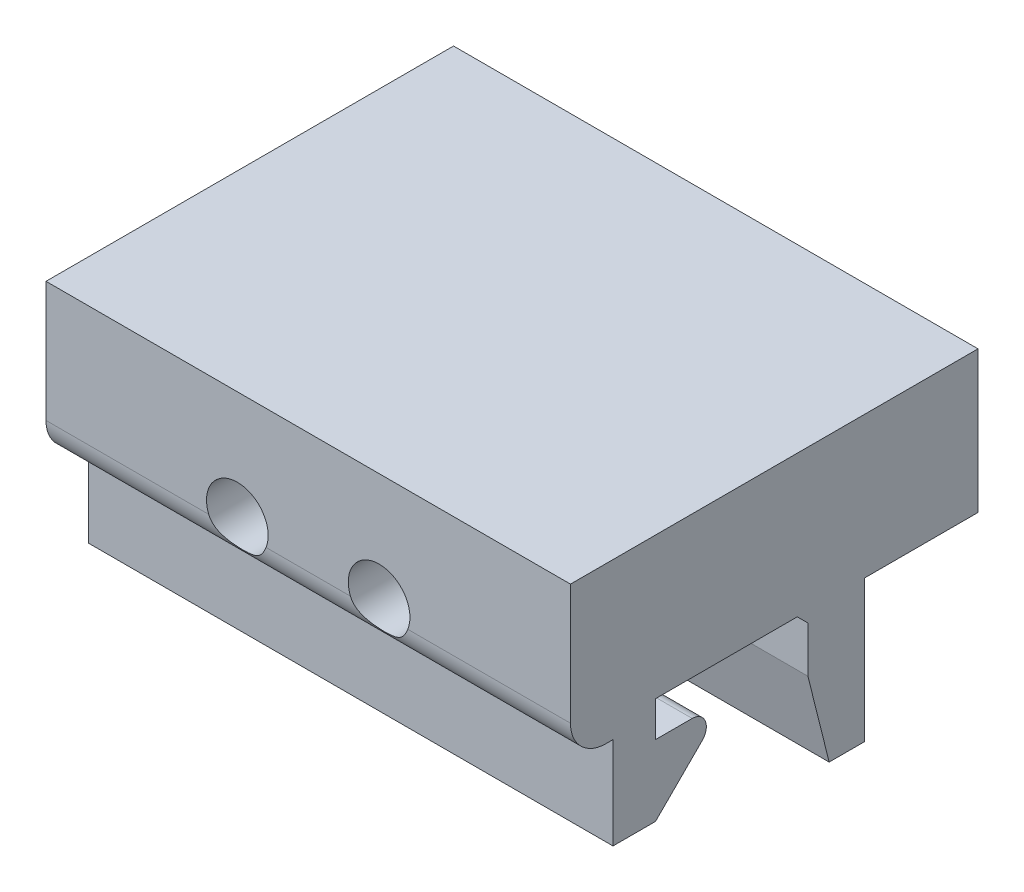
ISO-10303-21;
HEADER;
FILE_DESCRIPTION(('STEP AP214'),'2;1');
FILE_NAME('part.step','',(''),(''),'','','');
FILE_SCHEMA(('AUTOMOTIVE_DESIGN { 1 0 10303 214 1 1 1 1 }'));
ENDSEC;
DATA;
#1=APPLICATION_CONTEXT('core data for automotive mechanical design processes');
#2=APPLICATION_PROTOCOL_DEFINITION('international standard','automotive_design',2000,#1);
#3=PRODUCT_CONTEXT('',#1,'mechanical');
#4=PRODUCT('Part','Part','',(#3));
#5=PRODUCT_RELATED_PRODUCT_CATEGORY('part','',(#4));
#6=PRODUCT_DEFINITION_FORMATION('','',#4);
#7=PRODUCT_DEFINITION_CONTEXT('part definition',#1,'design');
#8=PRODUCT_DEFINITION('design','',#6,#7);
#9=PRODUCT_DEFINITION_SHAPE('','',#8);
#10=(LENGTH_UNIT() NAMED_UNIT(*) SI_UNIT(.MILLI.,.METRE.));
#11=(NAMED_UNIT(*) PLANE_ANGLE_UNIT() SI_UNIT($,.RADIAN.));
#12=(NAMED_UNIT(*) SI_UNIT($,.STERADIAN.) SOLID_ANGLE_UNIT());
#13=UNCERTAINTY_MEASURE_WITH_UNIT(LENGTH_MEASURE(1.E-05),#10,'distance_accuracy_value','');
#14=(GEOMETRIC_REPRESENTATION_CONTEXT(3) GLOBAL_UNCERTAINTY_ASSIGNED_CONTEXT((#13)) GLOBAL_UNIT_ASSIGNED_CONTEXT((#10,
#11,#12)) REPRESENTATION_CONTEXT('',''));
#15=CARTESIAN_POINT('',(0.,0.,0.));
#16=DIRECTION('',(0.,0.,1.));
#17=DIRECTION('',(1.,0.,0.));
#18=AXIS2_PLACEMENT_3D('',#15,#16,#17);
#19=CARTESIAN_POINT('',(37.,0.,3.));
#20=DIRECTION('',(0.,0.,-1.));
#21=DIRECTION('',(0.,1.,0.));
#22=AXIS2_PLACEMENT_3D('',#19,#20,#21);
#23=PLANE('',#22);
#24=DIRECTION('',(-1.,0.,0.));
#25=VECTOR('',#24,1.);
#26=CARTESIAN_POINT('',(37.,-8.5,3.));
#27=LINE('',#26,#25);
#28=CARTESIAN_POINT('',(11.4774706429819,-8.5,3.));
#29=VERTEX_POINT('',#28);
#30=CARTESIAN_POINT('',(0.,-8.5,3.));
#31=VERTEX_POINT('',#30);
#32=EDGE_CURVE('E191',#29,#31,#27,.T.);
#33=ORIENTED_EDGE('',*,*,#32,.F.);
#34=CARTESIAN_POINT('',(13.5,-7.7,3.));
#35=DIRECTION('',(0.,0.,-1.));
#36=DIRECTION('',(0.,1.,0.));
#37=AXIS2_PLACEMENT_3D('',#34,#35,#36);
#38=CIRCLE('',#37,2.175);
#39=CARTESIAN_POINT('',(15.5225293570181,-8.5,3.));
#40=VERTEX_POINT('',#39);
#41=EDGE_CURVE('E53',#29,#40,#38,.T.);
#42=ORIENTED_EDGE('',*,*,#41,.T.);
#43=CARTESIAN_POINT('',(21.4774706429819,-8.5,3.));
#44=VERTEX_POINT('',#43);
#45=EDGE_CURVE('E185',#44,#40,#27,.T.);
#46=ORIENTED_EDGE('',*,*,#45,.F.);
#47=CARTESIAN_POINT('',(23.5,-7.7,3.));
#48=DIRECTION('',(0.,0.,-1.));
#49=DIRECTION('',(0.,1.,0.));
#50=AXIS2_PLACEMENT_3D('',#47,#48,#49);
#51=CIRCLE('',#50,2.175);
#52=CARTESIAN_POINT('',(25.5225293570181,-8.5,3.));
#53=VERTEX_POINT('',#52);
#54=EDGE_CURVE('E60',#44,#53,#51,.T.);
#55=ORIENTED_EDGE('',*,*,#54,.T.);
#56=CARTESIAN_POINT('',(37.,-8.5,3.));
#57=VERTEX_POINT('',#56);
#58=EDGE_CURVE('E47',#57,#53,#27,.T.);
#59=ORIENTED_EDGE('',*,*,#58,.F.);
#60=DIRECTION('',(0.,-1.,0.));
#61=VECTOR('',#60,1.);
#62=CARTESIAN_POINT('',(37.,0.,3.));
#63=LINE('',#62,#61);
#64=CARTESIAN_POINT('',(37.,0.,3.));
#65=VERTEX_POINT('',#64);
#66=EDGE_CURVE('E315',#65,#57,#63,.T.);
#67=ORIENTED_EDGE('',*,*,#66,.F.);
#68=DIRECTION('',(-1.,0.,0.));
#69=VECTOR('',#68,1.);
#70=CARTESIAN_POINT('',(37.,0.,3.));
#71=LINE('',#70,#69);
#72=CARTESIAN_POINT('',(0.,0.,3.));
#73=VERTEX_POINT('',#72);
#74=EDGE_CURVE('E12',#65,#73,#71,.T.);
#75=ORIENTED_EDGE('',*,*,#74,.T.);
#76=DIRECTION('',(0.,-1.,0.));
#77=VECTOR('',#76,1.);
#78=CARTESIAN_POINT('',(0.,0.,3.));
#79=LINE('',#78,#77);
#80=EDGE_CURVE('E282',#73,#31,#79,.T.);
#81=ORIENTED_EDGE('',*,*,#80,.T.);
#82=EDGE_LOOP('',(#33,#42,#46,#55,#59,#67,#75,#81));
#83=FACE_BOUND('',#82,.T.);
#84=ADVANCED_FACE('F40',(#83),#23,.F.);
#85=CARTESIAN_POINT('',(37.,-8.5,0.5));
#86=DIRECTION('',(-1.,0.,0.));
#87=DIRECTION('',(0.,0.,1.));
#88=AXIS2_PLACEMENT_3D('',#85,#86,#87);
#89=CYLINDRICAL_SURFACE('',#88,2.5);
#90=ORIENTED_EDGE('',*,*,#45,.T.);
#91=CARTESIAN_POINT('',(15.5225293570181,-8.5,3.));
#92=CARTESIAN_POINT('',(15.5015826202919,-8.55298797162307,3.0000097026096));
#93=CARTESIAN_POINT('',(15.4785430854911,-8.6051186813735,2.99831591961302));
#94=CARTESIAN_POINT('',(15.4285642058998,-8.7072130496289,2.99191943818065));
#95=CARTESIAN_POINT('',(15.4016294264473,-8.75717915722952,2.98722024041105));
#96=CARTESIAN_POINT('',(15.3443056379318,-8.85426168741713,2.97525294985885));
#97=CARTESIAN_POINT('',(15.3139432404392,-8.90139622814896,2.96800383324103));
#98=CARTESIAN_POINT('',(15.2498767901893,-8.99293470232446,2.95136321836435));
#99=CARTESIAN_POINT('',(15.2161718202242,-9.03733788083158,2.94197113114578));
#100=CARTESIAN_POINT('',(15.1107407868066,-9.16572578397342,2.91133037457622));
#101=CARTESIAN_POINT('',(15.0344005304526,-9.24538939648387,2.88754710127813));
#102=CARTESIAN_POINT('',(14.8710700146723,-9.39200787889851,2.83674441167139));
#103=CARTESIAN_POINT('',(14.7840522857691,-9.45892878914694,2.80971665245384));
#104=CARTESIAN_POINT('',(14.5903270823497,-9.58592802278831,2.75302541848955));
#105=CARTESIAN_POINT('',(14.4825059988771,-9.64434175989313,2.72341509826142));
#106=CARTESIAN_POINT('',(14.257305611954,-9.74258132504188,2.67005711786855));
#107=CARTESIAN_POINT('',(14.1399368201975,-9.78242727877475,2.64630312322921));
#108=CARTESIAN_POINT('',(13.9600055304423,-9.82667960035014,2.6190101736994));
#109=CARTESIAN_POINT('',(13.8998896512772,-9.8388065063577,2.61133200249888));
#110=CARTESIAN_POINT('',(13.778552954459,-9.85796153929386,2.5990649040165));
#111=CARTESIAN_POINT('',(13.7173327730243,-9.86499251166478,2.59447425284377));
#112=CARTESIAN_POINT('',(13.5944005986964,-9.87382326088717,2.58869298773142));
#113=CARTESIAN_POINT('',(13.5326890204575,-9.87562705857995,2.58749976044166));
#114=CARTESIAN_POINT('',(13.4093862521222,-9.87398726050777,2.58857747830008));
#115=CARTESIAN_POINT('',(13.3477950493491,-9.87054425082251,2.59084803653598));
#116=CARTESIAN_POINT('',(13.1829675017264,-9.85427987518561,2.60145193749581));
#117=CARTESIAN_POINT('',(13.0803640056228,-9.83662192913006,2.61289058402241));
#118=CARTESIAN_POINT('',(12.8798201867286,-9.7872723798173,2.64330238911416));
#119=CARTESIAN_POINT('',(12.7818828397692,-9.75557195023334,2.66228028565858));
#120=CARTESIAN_POINT('',(12.5864000735374,-9.67680203333114,2.7061935488159));
#121=CARTESIAN_POINT('',(12.4892603112514,-9.6288970808153,2.73142672525987));
#122=CARTESIAN_POINT('',(12.3033649349741,-9.51943544585463,2.78351151894148));
#123=CARTESIAN_POINT('',(12.2146196897576,-9.45786218661716,2.81036507231278));
#124=CARTESIAN_POINT('',(12.0338290357502,-9.31137307995515,2.8661651684843));
#125=CARTESIAN_POINT('',(11.9434018512542,-9.22431884349568,2.89479157410548));
#126=CARTESIAN_POINT('',(11.7781519310466,-9.03475284555837,2.9440862751369));
#127=CARTESIAN_POINT('',(11.7032822471054,-8.93228924741966,2.96477867776393));
#128=CARTESIAN_POINT('',(11.6066706359324,-8.77216644108768,2.98568282679954));
#129=CARTESIAN_POINT('',(11.5777434674874,-8.7194004301527,2.99093997852295));
#130=CARTESIAN_POINT('',(11.5242534821432,-8.61142121659454,2.99810372468316));
#131=CARTESIAN_POINT('',(11.4996951074076,-8.55620559366838,3.00000692615297));
#132=CARTESIAN_POINT('',(11.4774706429819,-8.49999999999999,3.));
#133=B_SPLINE_CURVE_WITH_KNOTS('',3,(#91,#92,#93,#94,#95,#96,#97,#98,#99,#100,#101,#102,#103,
#104,#105,#106,#107,#108,#109,#110,#111,#112,#113,#114,#115,#116,#117,#118,#119,#120,#121,#122,
#123,#124,#125,#126,#127,#128,#129,#130,#131,#132),.UNSPECIFIED.,.F.,.F.,(4,2,2,2,2,2,2,2,2,2,2,
2,2,2,2,2,2,2,2,2,4),(0.,0.170823188820516,0.341447766598374,0.510828543898471,
0.680255928871122,1.01737185514567,1.35537400179999,1.73213469962146,2.10848606975889,
2.29365353590232,2.47871752932705,2.66363913020295,2.84854007645101,3.16121188412847,
3.47408049944766,3.80646854884444,4.13926193935948,4.52360592473594,4.90677265968212,
5.08771984588229,5.26884997938448),.UNSPECIFIED.);
#134=EDGE_CURVE('E179',#40,#29,#133,.T.);
#135=ORIENTED_EDGE('',*,*,#134,.T.);
#136=ORIENTED_EDGE('',*,*,#32,.T.);
#137=CARTESIAN_POINT('',(0.,-8.5,0.5));
#138=DIRECTION('',(1.,0.,0.));
#139=DIRECTION('',(0.,0.,1.));
#140=AXIS2_PLACEMENT_3D('',#137,#138,#139);
#141=CIRCLE('',#140,2.5);
#142=CARTESIAN_POINT('',(0.,-11.,0.49999999999998));
#143=VERTEX_POINT('',#142);
#144=EDGE_CURVE('E280',#31,#143,#141,.T.);
#145=ORIENTED_EDGE('',*,*,#144,.T.);
#146=DIRECTION('',(-1.,0.,0.));
#147=VECTOR('',#146,1.);
#148=CARTESIAN_POINT('',(37.,-11.,0.49999999999998));
#149=LINE('',#148,#147);
#150=CARTESIAN_POINT('',(37.,-11.,0.49999999999998));
#151=VERTEX_POINT('',#150);
#152=EDGE_CURVE('E193',#151,#143,#149,.T.);
#153=ORIENTED_EDGE('',*,*,#152,.F.);
#154=CARTESIAN_POINT('',(37.,-8.5,0.5));
#155=DIRECTION('',(1.,0.,0.));
#156=DIRECTION('',(0.,0.,1.));
#157=AXIS2_PLACEMENT_3D('',#154,#155,#156);
#158=CIRCLE('',#157,2.5);
#159=EDGE_CURVE('E190',#57,#151,#158,.T.);
#160=ORIENTED_EDGE('',*,*,#159,.F.);
#161=ORIENTED_EDGE('',*,*,#58,.T.);
#162=CARTESIAN_POINT('',(25.5225293570181,-8.5,3.));
#163=CARTESIAN_POINT('',(25.5015826202919,-8.55298797162307,3.0000097026096));
#164=CARTESIAN_POINT('',(25.4785430854911,-8.6051186813735,2.99831591961302));
#165=CARTESIAN_POINT('',(25.4285642058998,-8.7072130496289,2.99191943818065));
#166=CARTESIAN_POINT('',(25.4016294264473,-8.75717915722951,2.98722024041105));
#167=CARTESIAN_POINT('',(25.3443056379318,-8.85426168741712,2.97525294985885));
#168=CARTESIAN_POINT('',(25.3139432404392,-8.90139622814895,2.96800383324103));
#169=CARTESIAN_POINT('',(25.2498767901893,-8.99293470232446,2.95136321836435));
#170=CARTESIAN_POINT('',(25.2161718202242,-9.03733788083158,2.94197113114578));
#171=CARTESIAN_POINT('',(25.1107407868066,-9.16572578397342,2.91133037457622));
#172=CARTESIAN_POINT('',(25.0344005304526,-9.24538939648386,2.88754710127813));
#173=CARTESIAN_POINT('',(24.8710700146723,-9.3920078788985,2.83674441167139));
#174=CARTESIAN_POINT('',(24.7840522857691,-9.45892878914694,2.80971665245384));
#175=CARTESIAN_POINT('',(24.5903270823497,-9.58592802278831,2.75302541848955));
#176=CARTESIAN_POINT('',(24.4825059988771,-9.64434175989313,2.72341509826142));
#177=CARTESIAN_POINT('',(24.257305611954,-9.74258132504188,2.67005711786855));
#178=CARTESIAN_POINT('',(24.1399368201975,-9.78242727877475,2.64630312322921));
#179=CARTESIAN_POINT('',(23.9600055304423,-9.82667960035014,2.6190101736994));
#180=CARTESIAN_POINT('',(23.8998896512772,-9.8388065063577,2.61133200249888));
#181=CARTESIAN_POINT('',(23.778552954459,-9.85796153929386,2.5990649040165));
#182=CARTESIAN_POINT('',(23.7173327730243,-9.86499251166478,2.59447425284377));
#183=CARTESIAN_POINT('',(23.5944005986964,-9.87382326088717,2.58869298773142));
#184=CARTESIAN_POINT('',(23.5326890204575,-9.87562705857995,2.58749976044166));
#185=CARTESIAN_POINT('',(23.4093862521222,-9.87398726050777,2.58857747830008));
#186=CARTESIAN_POINT('',(23.3477950493491,-9.87054425082251,2.59084803653598));
#187=CARTESIAN_POINT('',(23.1829675017264,-9.85427987518561,2.60145193749581));
#188=CARTESIAN_POINT('',(23.0803640056228,-9.83662192913006,2.61289058402241));
#189=CARTESIAN_POINT('',(22.8798201867286,-9.7872723798173,2.64330238911416));
#190=CARTESIAN_POINT('',(22.7818828397692,-9.75557195023334,2.66228028565858));
#191=CARTESIAN_POINT('',(22.5864000735374,-9.67680203333114,2.7061935488159));
#192=CARTESIAN_POINT('',(22.4892603112514,-9.6288970808153,2.73142672525986));
#193=CARTESIAN_POINT('',(22.3033649349741,-9.51943544585463,2.78351151894148));
#194=CARTESIAN_POINT('',(22.2146196897576,-9.45786218661717,2.81036507231278));
#195=CARTESIAN_POINT('',(22.0338290357502,-9.31137307995515,2.8661651684843));
#196=CARTESIAN_POINT('',(21.9434018512542,-9.22431884349568,2.89479157410548));
#197=CARTESIAN_POINT('',(21.7781519310466,-9.03475284555837,2.9440862751369));
#198=CARTESIAN_POINT('',(21.7032822471054,-8.93228924741966,2.96477867776393));
#199=CARTESIAN_POINT('',(21.6066706359324,-8.77216644108768,2.98568282679954));
#200=CARTESIAN_POINT('',(21.5777434674874,-8.7194004301527,2.99093997852295));
#201=CARTESIAN_POINT('',(21.5242534821432,-8.61142121659454,2.99810372468316));
#202=CARTESIAN_POINT('',(21.4996951074076,-8.55620559366838,3.00000692615297));
#203=CARTESIAN_POINT('',(21.4774706429819,-8.49999999999999,3.));
#204=B_SPLINE_CURVE_WITH_KNOTS('',3,(#162,#163,#164,#165,#166,#167,#168,#169,#170,#171,#172,
#173,#174,#175,#176,#177,#178,#179,#180,#181,#182,#183,#184,#185,#186,#187,#188,#189,#190,#191,
#192,#193,#194,#195,#196,#197,#198,#199,#200,#201,#202,#203),.UNSPECIFIED.,.F.,.F.,(4,2,2,2,2,2,
2,2,2,2,2,2,2,2,2,2,2,2,2,2,4),(0.,0.170823188820514,0.341447766598374,0.51082854389847,
0.680255928871123,1.01737185514567,1.35537400179999,1.73213469962146,2.10848606975889,
2.29365353590231,2.47871752932705,2.66363913020294,2.848540076451,3.16121188412846,
3.47408049944766,3.80646854884444,4.13926193935948,4.52360592473594,4.90677265968212,
5.08771984588229,5.26884997938448),.UNSPECIFIED.);
#205=EDGE_CURVE('E173',#53,#44,#204,.T.);
#206=ORIENTED_EDGE('',*,*,#205,.T.);
#207=EDGE_LOOP('',(#90,#135,#136,#145,#153,#160,#161,#206));
#208=FACE_BOUND('',#207,.T.);
#209=ADVANCED_FACE('F188',(#208),#89,.T.);
#210=CARTESIAN_POINT('',(37.,-11.,0.49999999999998));
#211=DIRECTION('',(0.,1.,0.));
#212=DIRECTION('',(0.,0.,1.));
#213=AXIS2_PLACEMENT_3D('',#210,#211,#212);
#214=PLANE('',#213);
#215=DIRECTION('',(0.,0.,-1.));
#216=VECTOR('',#215,1.);
#217=CARTESIAN_POINT('',(0.,-11.,0.49999999999998));
#218=LINE('',#217,#216);
#219=CARTESIAN_POINT('',(0.,-11.,0.));
#220=VERTEX_POINT('',#219);
#221=EDGE_CURVE('E278',#143,#220,#218,.T.);
#222=ORIENTED_EDGE('',*,*,#221,.T.);
#223=DIRECTION('',(-1.,0.,0.));
#224=VECTOR('',#223,1.);
#225=CARTESIAN_POINT('',(37.,-11.,0.));
#226=LINE('',#225,#224);
#227=CARTESIAN_POINT('',(37.,-11.,0.));
#228=VERTEX_POINT('',#227);
#229=EDGE_CURVE('E196',#228,#220,#226,.T.);
#230=ORIENTED_EDGE('',*,*,#229,.F.);
#231=DIRECTION('',(0.,0.,-1.));
#232=VECTOR('',#231,1.);
#233=CARTESIAN_POINT('',(37.,-11.,0.49999999999998));
#234=LINE('',#233,#232);
#235=EDGE_CURVE('E312',#151,#228,#234,.T.);
#236=ORIENTED_EDGE('',*,*,#235,.F.);
#237=ORIENTED_EDGE('',*,*,#152,.T.);
#238=EDGE_LOOP('',(#222,#230,#236,#237));
#239=FACE_BOUND('',#238,.T.);
#240=ADVANCED_FACE('F406',(#239),#214,.F.);
#241=CARTESIAN_POINT('',(37.,-17.5,0.));
#242=DIRECTION('',(0.,0.,-1.));
#243=DIRECTION('',(0.,1.,0.));
#244=AXIS2_PLACEMENT_3D('',#241,#242,#243);
#245=PLANE('',#244);
#246=DIRECTION('',(0.,-1.,0.));
#247=VECTOR('',#246,1.);
#248=CARTESIAN_POINT('',(0.,-17.5,0.));
#249=LINE('',#248,#247);
#250=CARTESIAN_POINT('',(0.,-17.5,0.));
#251=VERTEX_POINT('',#250);
#252=EDGE_CURVE('E276',#220,#251,#249,.T.);
#253=ORIENTED_EDGE('',*,*,#252,.T.);
#254=DIRECTION('',(-1.,0.,0.));
#255=VECTOR('',#254,1.);
#256=CARTESIAN_POINT('',(37.,-17.5,0.));
#257=LINE('',#256,#255);
#258=CARTESIAN_POINT('',(37.,-17.5,0.));
#259=VERTEX_POINT('',#258);
#260=EDGE_CURVE('E201',#259,#251,#257,.T.);
#261=ORIENTED_EDGE('',*,*,#260,.F.);
#262=DIRECTION('',(0.,-1.,0.));
#263=VECTOR('',#262,1.);
#264=CARTESIAN_POINT('',(37.,-17.5,0.));
#265=LINE('',#264,#263);
#266=EDGE_CURVE('E310',#228,#259,#265,.T.);
#267=ORIENTED_EDGE('',*,*,#266,.F.);
#268=ORIENTED_EDGE('',*,*,#229,.T.);
#269=EDGE_LOOP('',(#253,#261,#267,#268));
#270=FACE_BOUND('',#269,.T.);
#271=ADVANCED_FACE('F403',(#270),#245,.F.);
#272=CARTESIAN_POINT('',(37.,-17.5,-3.));
#273=DIRECTION('',(0.,1.,0.));
#274=DIRECTION('',(0.,0.,1.));
#275=AXIS2_PLACEMENT_3D('',#272,#273,#274);
#276=PLANE('',#275);
#277=DIRECTION('',(0.,0.,-1.));
#278=VECTOR('',#277,1.);
#279=CARTESIAN_POINT('',(0.,-17.5,-3.));
#280=LINE('',#279,#278);
#281=CARTESIAN_POINT('',(0.,-17.5,-3.));
#282=VERTEX_POINT('',#281);
#283=EDGE_CURVE('E274',#251,#282,#280,.T.);
#284=ORIENTED_EDGE('',*,*,#283,.T.);
#285=DIRECTION('',(-1.,0.,0.));
#286=VECTOR('',#285,1.);
#287=CARTESIAN_POINT('',(37.,-17.5,-3.));
#288=LINE('',#287,#286);
#289=CARTESIAN_POINT('',(37.,-17.5,-3.));
#290=VERTEX_POINT('',#289);
#291=EDGE_CURVE('E206',#290,#282,#288,.T.);
#292=ORIENTED_EDGE('',*,*,#291,.F.);
#293=DIRECTION('',(0.,0.,-1.));
#294=VECTOR('',#293,1.);
#295=CARTESIAN_POINT('',(37.,-17.5,-3.));
#296=LINE('',#295,#294);
#297=EDGE_CURVE('E308',#259,#290,#296,.T.);
#298=ORIENTED_EDGE('',*,*,#297,.F.);
#299=ORIENTED_EDGE('',*,*,#260,.T.);
#300=EDGE_LOOP('',(#284,#292,#298,#299));
#301=FACE_BOUND('',#300,.T.);
#302=ADVANCED_FACE('F399',(#301),#276,.F.);
#303=CARTESIAN_POINT('',(37.,-14.2071067811865,-6.29289321881345));
#304=DIRECTION('',(0.,0.707106781186548,0.707106781186547));
#305=DIRECTION('',(0.,-0.707106781186547,0.707106781186548));
#306=AXIS2_PLACEMENT_3D('',#303,#304,#305);
#307=PLANE('',#306);
#308=DIRECTION('',(0.,0.707106781186547,-0.707106781186548));
#309=VECTOR('',#308,1.);
#310=CARTESIAN_POINT('',(0.,-14.2071067811865,-6.29289321881345));
#311=LINE('',#310,#309);
#312=CARTESIAN_POINT('',(0.,-14.2071067811865,-6.29289321881345));
#313=VERTEX_POINT('',#312);
#314=EDGE_CURVE('E272',#282,#313,#311,.T.);
#315=ORIENTED_EDGE('',*,*,#314,.T.);
#316=DIRECTION('',(-1.,0.,0.));
#317=VECTOR('',#316,1.);
#318=CARTESIAN_POINT('',(37.,-14.2071067811865,-6.29289321881345));
#319=LINE('',#318,#317);
#320=CARTESIAN_POINT('',(37.,-14.2071067811865,-6.29289321881345));
#321=VERTEX_POINT('',#320);
#322=EDGE_CURVE('E209',#321,#313,#319,.T.);
#323=ORIENTED_EDGE('',*,*,#322,.F.);
#324=DIRECTION('',(0.,0.707106781186547,-0.707106781186548));
#325=VECTOR('',#324,1.);
#326=CARTESIAN_POINT('',(37.,-14.2071067811865,-6.29289321881345));
#327=LINE('',#326,#325);
#328=EDGE_CURVE('E306',#290,#321,#327,.T.);
#329=ORIENTED_EDGE('',*,*,#328,.F.);
#330=ORIENTED_EDGE('',*,*,#291,.T.);
#331=EDGE_LOOP('',(#315,#323,#329,#330));
#332=FACE_BOUND('',#331,.T.);
#333=ADVANCED_FACE('F395',(#332),#307,.F.);
#334=CARTESIAN_POINT('',(37.,-13.5,-5.58578643762691));
#335=DIRECTION('',(-1.,0.,0.));
#336=DIRECTION('',(0.,0.,1.));
#337=AXIS2_PLACEMENT_3D('',#334,#335,#336);
#338=CYLINDRICAL_SURFACE('',#337,1.);
#339=CARTESIAN_POINT('',(0.,-13.5,-5.58578643762691));
#340=DIRECTION('',(1.,0.,0.));
#341=DIRECTION('',(0.,0.,1.));
#342=AXIS2_PLACEMENT_3D('',#339,#340,#341);
#343=CIRCLE('',#342,1.);
#344=CARTESIAN_POINT('',(0.,-12.5,-5.58578643762691));
#345=VERTEX_POINT('',#344);
#346=EDGE_CURVE('E270',#313,#345,#343,.T.);
#347=ORIENTED_EDGE('',*,*,#346,.T.);
#348=DIRECTION('',(-1.,0.,0.));
#349=VECTOR('',#348,1.);
#350=CARTESIAN_POINT('',(37.,-12.5,-5.58578643762691));
#351=LINE('',#350,#349);
#352=CARTESIAN_POINT('',(37.,-12.5,-5.58578643762691));
#353=VERTEX_POINT('',#352);
#354=EDGE_CURVE('E212',#353,#345,#351,.T.);
#355=ORIENTED_EDGE('',*,*,#354,.F.);
#356=CARTESIAN_POINT('',(37.,-13.5,-5.58578643762691));
#357=DIRECTION('',(1.,0.,0.));
#358=DIRECTION('',(0.,0.,1.));
#359=AXIS2_PLACEMENT_3D('',#356,#357,#358);
#360=CIRCLE('',#359,1.);
#361=EDGE_CURVE('E304',#321,#353,#360,.T.);
#362=ORIENTED_EDGE('',*,*,#361,.F.);
#363=ORIENTED_EDGE('',*,*,#322,.T.);
#364=EDGE_LOOP('',(#347,#355,#362,#363));
#365=FACE_BOUND('',#364,.T.);
#366=ADVANCED_FACE('F391',(#365),#338,.T.);
#367=CARTESIAN_POINT('',(37.,-12.5,-3.));
#368=DIRECTION('',(0.,-1.,0.));
#369=DIRECTION('',(0.,0.,-1.));
#370=AXIS2_PLACEMENT_3D('',#367,#368,#369);
#371=PLANE('',#370);
#372=DIRECTION('',(0.,0.,1.));
#373=VECTOR('',#372,1.);
#374=CARTESIAN_POINT('',(0.,-12.5,-3.));
#375=LINE('',#374,#373);
#376=CARTESIAN_POINT('',(0.,-12.5,-3.));
#377=VERTEX_POINT('',#376);
#378=EDGE_CURVE('E268',#345,#377,#375,.T.);
#379=ORIENTED_EDGE('',*,*,#378,.T.);
#380=DIRECTION('',(-1.,0.,0.));
#381=VECTOR('',#380,1.);
#382=CARTESIAN_POINT('',(37.,-12.5,-3.));
#383=LINE('',#382,#381);
#384=CARTESIAN_POINT('',(37.,-12.5,-3.));
#385=VERTEX_POINT('',#384);
#386=EDGE_CURVE('E215',#385,#377,#383,.T.);
#387=ORIENTED_EDGE('',*,*,#386,.F.);
#388=DIRECTION('',(0.,0.,1.));
#389=VECTOR('',#388,1.);
#390=CARTESIAN_POINT('',(37.,-12.5,-3.));
#391=LINE('',#390,#389);
#392=EDGE_CURVE('E302',#353,#385,#391,.T.);
#393=ORIENTED_EDGE('',*,*,#392,.F.);
#394=ORIENTED_EDGE('',*,*,#354,.T.);
#395=EDGE_LOOP('',(#379,#387,#393,#394));
#396=FACE_BOUND('',#395,.T.);
#397=ADVANCED_FACE('F387',(#396),#371,.F.);
#398=CARTESIAN_POINT('',(37.,-10.,-3.));
#399=DIRECTION('',(0.,0.,1.));
#400=DIRECTION('',(1.,0.,0.));
#401=AXIS2_PLACEMENT_3D('',#398,#399,#400);
#402=PLANE('',#401);
#403=DIRECTION('',(0.,1.,0.));
#404=VECTOR('',#403,1.);
#405=CARTESIAN_POINT('',(0.,-10.,-3.));
#406=LINE('',#405,#404);
#407=CARTESIAN_POINT('',(0.,-10.,-3.));
#408=VERTEX_POINT('',#407);
#409=EDGE_CURVE('E266',#377,#408,#406,.T.);
#410=ORIENTED_EDGE('',*,*,#409,.T.);
#411=DIRECTION('',(-1.,0.,0.));
#412=VECTOR('',#411,1.);
#413=CARTESIAN_POINT('',(37.,-10.,-3.));
#414=LINE('',#413,#412);
#415=CARTESIAN_POINT('',(37.,-10.,-3.));
#416=VERTEX_POINT('',#415);
#417=EDGE_CURVE('E218',#416,#408,#414,.T.);
#418=ORIENTED_EDGE('',*,*,#417,.F.);
#419=DIRECTION('',(0.,1.,0.));
#420=VECTOR('',#419,1.);
#421=CARTESIAN_POINT('',(37.,-10.,-3.));
#422=LINE('',#421,#420);
#423=EDGE_CURVE('E300',#385,#416,#422,.T.);
#424=ORIENTED_EDGE('',*,*,#423,.F.);
#425=ORIENTED_EDGE('',*,*,#386,.T.);
#426=EDGE_LOOP('',(#410,#418,#424,#425));
#427=FACE_BOUND('',#426,.T.);
#428=ADVANCED_FACE('F383',(#427),#402,.F.);
#429=CARTESIAN_POINT('',(37.,-10.,-13.));
#430=DIRECTION('',(0.,1.,0.));
#431=DIRECTION('',(0.,0.,1.));
#432=AXIS2_PLACEMENT_3D('',#429,#430,#431);
#433=PLANE('',#432);
#434=DIRECTION('',(0.,0.,-1.));
#435=VECTOR('',#434,1.);
#436=CARTESIAN_POINT('',(0.,-10.,-13.));
#437=LINE('',#436,#435);
#438=CARTESIAN_POINT('',(0.,-10.,-13.));
#439=VERTEX_POINT('',#438);
#440=EDGE_CURVE('E264',#408,#439,#437,.T.);
#441=ORIENTED_EDGE('',*,*,#440,.T.);
#442=DIRECTION('',(-1.,0.,0.));
#443=VECTOR('',#442,1.);
#444=CARTESIAN_POINT('',(37.,-10.,-13.));
#445=LINE('',#444,#443);
#446=CARTESIAN_POINT('',(37.,-10.,-13.));
#447=VERTEX_POINT('',#446);
#448=EDGE_CURVE('E221',#447,#439,#445,.T.);
#449=ORIENTED_EDGE('',*,*,#448,.F.);
#450=DIRECTION('',(0.,0.,-1.));
#451=VECTOR('',#450,1.);
#452=CARTESIAN_POINT('',(37.,-10.,-13.));
#453=LINE('',#452,#451);
#454=EDGE_CURVE('E298',#416,#447,#453,.T.);
#455=ORIENTED_EDGE('',*,*,#454,.F.);
#456=ORIENTED_EDGE('',*,*,#417,.T.);
#457=EDGE_LOOP('',(#441,#449,#455,#456));
#458=FACE_BOUND('',#457,.T.);
#459=ADVANCED_FACE('F379',(#458),#433,.F.);
#460=CARTESIAN_POINT('',(37.,-10.75,-13.75));
#461=DIRECTION('',(0.,0.707106781186548,-0.707106781186547));
#462=DIRECTION('',(0.,0.707106781186547,0.707106781186548));
#463=AXIS2_PLACEMENT_3D('',#460,#461,#462);
#464=PLANE('',#463);
#465=DIRECTION('',(0.,-0.707106781186547,-0.707106781186548));
#466=VECTOR('',#465,1.);
#467=CARTESIAN_POINT('',(0.,-10.75,-13.75));
#468=LINE('',#467,#466);
#469=CARTESIAN_POINT('',(0.,-10.75,-13.75));
#470=VERTEX_POINT('',#469);
#471=EDGE_CURVE('E262',#439,#470,#468,.T.);
#472=ORIENTED_EDGE('',*,*,#471,.T.);
#473=DIRECTION('',(-1.,0.,0.));
#474=VECTOR('',#473,1.);
#475=CARTESIAN_POINT('',(37.,-10.75,-13.75));
#476=LINE('',#475,#474);
#477=CARTESIAN_POINT('',(37.,-10.75,-13.75));
#478=VERTEX_POINT('',#477);
#479=EDGE_CURVE('E224',#478,#470,#476,.T.);
#480=ORIENTED_EDGE('',*,*,#479,.F.);
#481=DIRECTION('',(0.,-0.707106781186547,-0.707106781186548));
#482=VECTOR('',#481,1.);
#483=CARTESIAN_POINT('',(37.,-10.75,-13.75));
#484=LINE('',#483,#482);
#485=EDGE_CURVE('E296',#447,#478,#484,.T.);
#486=ORIENTED_EDGE('',*,*,#485,.F.);
#487=ORIENTED_EDGE('',*,*,#448,.T.);
#488=EDGE_LOOP('',(#472,#480,#486,#487));
#489=FACE_BOUND('',#488,.T.);
#490=ADVANCED_FACE('F375',(#489),#464,.F.);
#491=CARTESIAN_POINT('',(37.,-14.,-13.75));
#492=DIRECTION('',(0.,0.,-1.));
#493=DIRECTION('',(0.,1.,0.));
#494=AXIS2_PLACEMENT_3D('',#491,#492,#493);
#495=PLANE('',#494);
#496=DIRECTION('',(0.,-1.,0.));
#497=VECTOR('',#496,1.);
#498=CARTESIAN_POINT('',(0.,-14.,-13.75));
#499=LINE('',#498,#497);
#500=CARTESIAN_POINT('',(0.,-14.,-13.75));
#501=VERTEX_POINT('',#500);
#502=EDGE_CURVE('E260',#470,#501,#499,.T.);
#503=ORIENTED_EDGE('',*,*,#502,.T.);
#504=DIRECTION('',(-1.,0.,0.));
#505=VECTOR('',#504,1.);
#506=CARTESIAN_POINT('',(37.,-14.,-13.75));
#507=LINE('',#506,#505);
#508=CARTESIAN_POINT('',(37.,-14.,-13.75));
#509=VERTEX_POINT('',#508);
#510=EDGE_CURVE('E227',#509,#501,#507,.T.);
#511=ORIENTED_EDGE('',*,*,#510,.F.);
#512=DIRECTION('',(0.,-1.,0.));
#513=VECTOR('',#512,1.);
#514=CARTESIAN_POINT('',(37.,-14.,-13.75));
#515=LINE('',#514,#513);
#516=EDGE_CURVE('E294',#478,#509,#515,.T.);
#517=ORIENTED_EDGE('',*,*,#516,.F.);
#518=ORIENTED_EDGE('',*,*,#479,.T.);
#519=EDGE_LOOP('',(#503,#511,#517,#518));
#520=FACE_BOUND('',#519,.T.);
#521=ADVANCED_FACE('F371',(#520),#495,.F.);
#522=CARTESIAN_POINT('',(37.,-20.,-15.25));
#523=DIRECTION('',(0.,0.242535625036333,-0.970142500145332));
#524=DIRECTION('',(0.,0.970142500145332,0.242535625036333));
#525=AXIS2_PLACEMENT_3D('',#522,#523,#524);
#526=PLANE('',#525);
#527=DIRECTION('',(0.,-0.970142500145332,-0.242535625036333));
#528=VECTOR('',#527,1.);
#529=CARTESIAN_POINT('',(0.,-20.,-15.25));
#530=LINE('',#529,#528);
#531=CARTESIAN_POINT('',(0.,-20.,-15.25));
#532=VERTEX_POINT('',#531);
#533=EDGE_CURVE('E258',#501,#532,#530,.T.);
#534=ORIENTED_EDGE('',*,*,#533,.T.);
#535=DIRECTION('',(-1.,0.,0.));
#536=VECTOR('',#535,1.);
#537=CARTESIAN_POINT('',(37.,-20.,-15.25));
#538=LINE('',#537,#536);
#539=CARTESIAN_POINT('',(37.,-20.,-15.25));
#540=VERTEX_POINT('',#539);
#541=EDGE_CURVE('E230',#540,#532,#538,.T.);
#542=ORIENTED_EDGE('',*,*,#541,.F.);
#543=DIRECTION('',(0.,-0.970142500145332,-0.242535625036333));
#544=VECTOR('',#543,1.);
#545=CARTESIAN_POINT('',(37.,-20.,-15.25));
#546=LINE('',#545,#544);
#547=EDGE_CURVE('E292',#509,#540,#546,.T.);
#548=ORIENTED_EDGE('',*,*,#547,.F.);
#549=ORIENTED_EDGE('',*,*,#510,.T.);
#550=EDGE_LOOP('',(#534,#542,#548,#549));
#551=FACE_BOUND('',#550,.T.);
#552=ADVANCED_FACE('F367',(#551),#526,.F.);
#553=CARTESIAN_POINT('',(37.,-20.,-17.75));
#554=DIRECTION('',(0.,1.,0.));
#555=DIRECTION('',(0.,0.,1.));
#556=AXIS2_PLACEMENT_3D('',#553,#554,#555);
#557=PLANE('',#556);
#558=DIRECTION('',(0.,0.,-1.));
#559=VECTOR('',#558,1.);
#560=CARTESIAN_POINT('',(0.,-20.,-17.75));
#561=LINE('',#560,#559);
#562=CARTESIAN_POINT('',(0.,-20.,-17.75));
#563=VERTEX_POINT('',#562);
#564=EDGE_CURVE('E256',#532,#563,#561,.T.);
#565=ORIENTED_EDGE('',*,*,#564,.T.);
#566=DIRECTION('',(-1.,0.,0.));
#567=VECTOR('',#566,1.);
#568=CARTESIAN_POINT('',(37.,-20.,-17.75));
#569=LINE('',#568,#567);
#570=CARTESIAN_POINT('',(37.,-20.,-17.75));
#571=VERTEX_POINT('',#570);
#572=EDGE_CURVE('E233',#571,#563,#569,.T.);
#573=ORIENTED_EDGE('',*,*,#572,.F.);
#574=DIRECTION('',(0.,0.,-1.));
#575=VECTOR('',#574,1.);
#576=CARTESIAN_POINT('',(37.,-20.,-17.75));
#577=LINE('',#576,#575);
#578=EDGE_CURVE('E290',#540,#571,#577,.T.);
#579=ORIENTED_EDGE('',*,*,#578,.F.);
#580=ORIENTED_EDGE('',*,*,#541,.T.);
#581=EDGE_LOOP('',(#565,#573,#579,#580));
#582=FACE_BOUND('',#581,.T.);
#583=ADVANCED_FACE('F363',(#582),#557,.F.);
#584=CARTESIAN_POINT('',(37.,-10.,-17.75));
#585=DIRECTION('',(0.,0.,1.));
#586=DIRECTION('',(0.,-1.,0.));
#587=AXIS2_PLACEMENT_3D('',#584,#585,#586);
#588=PLANE('',#587);
#589=DIRECTION('',(0.,1.,0.));
#590=VECTOR('',#589,1.);
#591=CARTESIAN_POINT('',(0.,-10.,-17.75));
#592=LINE('',#591,#590);
#593=CARTESIAN_POINT('',(0.,-10.,-17.75));
#594=VERTEX_POINT('',#593);
#595=EDGE_CURVE('E254',#563,#594,#592,.T.);
#596=ORIENTED_EDGE('',*,*,#595,.T.);
#597=DIRECTION('',(-1.,0.,0.));
#598=VECTOR('',#597,1.);
#599=CARTESIAN_POINT('',(37.,-10.,-17.75));
#600=LINE('',#599,#598);
#601=CARTESIAN_POINT('',(37.,-10.,-17.75));
#602=VERTEX_POINT('',#601);
#603=EDGE_CURVE('E236',#602,#594,#600,.T.);
#604=ORIENTED_EDGE('',*,*,#603,.F.);
#605=DIRECTION('',(0.,1.,0.));
#606=VECTOR('',#605,1.);
#607=CARTESIAN_POINT('',(37.,-10.,-17.75));
#608=LINE('',#607,#606);
#609=EDGE_CURVE('E288',#571,#602,#608,.T.);
#610=ORIENTED_EDGE('',*,*,#609,.F.);
#611=ORIENTED_EDGE('',*,*,#572,.T.);
#612=EDGE_LOOP('',(#596,#604,#610,#611));
#613=FACE_BOUND('',#612,.T.);
#614=ADVANCED_FACE('F359',(#613),#588,.F.);
#615=CARTESIAN_POINT('',(37.,-10.,-17.75));
#616=DIRECTION('',(0.,1.,0.));
#617=DIRECTION('',(0.,0.,1.));
#618=AXIS2_PLACEMENT_3D('',#615,#616,#617);
#619=PLANE('',#618);
#620=DIRECTION('',(0.,0.,-1.));
#621=VECTOR('',#620,1.);
#622=CARTESIAN_POINT('',(0.,-10.,-17.75));
#623=LINE('',#622,#621);
#624=CARTESIAN_POINT('',(0.,-10.,-25.75));
#625=VERTEX_POINT('',#624);
#626=EDGE_CURVE('E252',#594,#625,#623,.T.);
#627=ORIENTED_EDGE('',*,*,#626,.T.);
#628=DIRECTION('',(-1.,0.,0.));
#629=VECTOR('',#628,1.);
#630=CARTESIAN_POINT('',(37.,-10.,-25.75));
#631=LINE('',#630,#629);
#632=CARTESIAN_POINT('',(37.,-10.,-25.75));
#633=VERTEX_POINT('',#632);
#634=EDGE_CURVE('E239',#633,#625,#631,.T.);
#635=ORIENTED_EDGE('',*,*,#634,.F.);
#636=DIRECTION('',(0.,0.,-1.));
#637=VECTOR('',#636,1.);
#638=CARTESIAN_POINT('',(37.,-10.,-17.75));
#639=LINE('',#638,#637);
#640=EDGE_CURVE('E286',#602,#633,#639,.T.);
#641=ORIENTED_EDGE('',*,*,#640,.F.);
#642=ORIENTED_EDGE('',*,*,#603,.T.);
#643=EDGE_LOOP('',(#627,#635,#641,#642));
#644=FACE_BOUND('',#643,.T.);
#645=ADVANCED_FACE('F355',(#644),#619,.F.);
#646=CARTESIAN_POINT('',(37.,0.,-25.75));
#647=DIRECTION('',(0.,0.,1.));
#648=DIRECTION('',(1.,0.,0.));
#649=AXIS2_PLACEMENT_3D('',#646,#647,#648);
#650=PLANE('',#649);
#651=CARTESIAN_POINT('',(13.5,-7.7,-25.75));
#652=DIRECTION('',(0.,0.,-1.));
#653=DIRECTION('',(0.,1.,0.));
#654=AXIS2_PLACEMENT_3D('',#651,#652,#653);
#655=CIRCLE('',#654,2.175);
#656=CARTESIAN_POINT('',(13.5,-5.525,-25.75));
#657=VERTEX_POINT('',#656);
#658=EDGE_CURVE('E684',#657,#657,#655,.T.);
#659=ORIENTED_EDGE('',*,*,#658,.F.);
#660=EDGE_LOOP('',(#659));
#661=FACE_BOUND('',#660,.T.);
#662=CARTESIAN_POINT('',(23.5,-7.7,-25.75));
#663=DIRECTION('',(0.,0.,-1.));
#664=DIRECTION('',(0.,1.,0.));
#665=AXIS2_PLACEMENT_3D('',#662,#663,#664);
#666=CIRCLE('',#665,2.175);
#667=CARTESIAN_POINT('',(23.5,-5.525,-25.75));
#668=VERTEX_POINT('',#667);
#669=EDGE_CURVE('E186',#668,#668,#666,.T.);
#670=ORIENTED_EDGE('',*,*,#669,.F.);
#671=EDGE_LOOP('',(#670));
#672=FACE_BOUND('',#671,.T.);
#673=DIRECTION('',(0.,1.,0.));
#674=VECTOR('',#673,1.);
#675=CARTESIAN_POINT('',(0.,0.,-25.75));
#676=LINE('',#675,#674);
#677=CARTESIAN_POINT('',(0.,0.,-25.75));
#678=VERTEX_POINT('',#677);
#679=EDGE_CURVE('E249',#625,#678,#676,.T.);
#680=ORIENTED_EDGE('',*,*,#679,.T.);
#681=DIRECTION('',(-1.,0.,0.));
#682=VECTOR('',#681,1.);
#683=CARTESIAN_POINT('',(37.,0.,-25.75));
#684=LINE('',#683,#682);
#685=CARTESIAN_POINT('',(37.,0.,-25.75));
#686=VERTEX_POINT('',#685);
#687=EDGE_CURVE('E242',#686,#678,#684,.T.);
#688=ORIENTED_EDGE('',*,*,#687,.F.);
#689=DIRECTION('',(0.,1.,0.));
#690=VECTOR('',#689,1.);
#691=CARTESIAN_POINT('',(37.,0.,-25.75));
#692=LINE('',#691,#690);
#693=EDGE_CURVE('E245',#633,#686,#692,.T.);
#694=ORIENTED_EDGE('',*,*,#693,.F.);
#695=ORIENTED_EDGE('',*,*,#634,.T.);
#696=EDGE_LOOP('',(#680,#688,#694,#695));
#697=FACE_BOUND('',#696,.T.);
#698=ADVANCED_FACE('F351',(#661,#672,#697),#650,.F.);
#699=CARTESIAN_POINT('',(37.,0.,0.));
#700=DIRECTION('',(0.,-1.,0.));
#701=DIRECTION('',(0.,0.,-1.));
#702=AXIS2_PLACEMENT_3D('',#699,#700,#701);
#703=PLANE('',#702);
#704=DIRECTION('',(0.,0.,1.));
#705=VECTOR('',#704,1.);
#706=CARTESIAN_POINT('',(0.,0.,0.));
#707=LINE('',#706,#705);
#708=EDGE_CURVE('E246',#678,#73,#707,.T.);
#709=ORIENTED_EDGE('',*,*,#708,.T.);
#710=ORIENTED_EDGE('',*,*,#74,.F.);
#711=DIRECTION('',(0.,0.,1.));
#712=VECTOR('',#711,1.);
#713=CARTESIAN_POINT('',(37.,0.,0.));
#714=LINE('',#713,#712);
#715=EDGE_CURVE('E248',#686,#65,#714,.T.);
#716=ORIENTED_EDGE('',*,*,#715,.F.);
#717=ORIENTED_EDGE('',*,*,#687,.T.);
#718=EDGE_LOOP('',(#709,#710,#716,#717));
#719=FACE_BOUND('',#718,.T.);
#720=ADVANCED_FACE('F344',(#719),#703,.F.);
#721=CARTESIAN_POINT('',(37.,-8.5,0.5));
#722=DIRECTION('',(-1.,0.,0.));
#723=DIRECTION('',(0.,0.,1.));
#724=AXIS2_PLACEMENT_3D('',#721,#722,#723);
#725=PLANE('',#724);
#726=ORIENTED_EDGE('',*,*,#715,.T.);
#727=ORIENTED_EDGE('',*,*,#66,.T.);
#728=ORIENTED_EDGE('',*,*,#159,.T.);
#729=ORIENTED_EDGE('',*,*,#235,.T.);
#730=ORIENTED_EDGE('',*,*,#266,.T.);
#731=ORIENTED_EDGE('',*,*,#297,.T.);
#732=ORIENTED_EDGE('',*,*,#328,.T.);
#733=ORIENTED_EDGE('',*,*,#361,.T.);
#734=ORIENTED_EDGE('',*,*,#392,.T.);
#735=ORIENTED_EDGE('',*,*,#423,.T.);
#736=ORIENTED_EDGE('',*,*,#454,.T.);
#737=ORIENTED_EDGE('',*,*,#485,.T.);
#738=ORIENTED_EDGE('',*,*,#516,.T.);
#739=ORIENTED_EDGE('',*,*,#547,.T.);
#740=ORIENTED_EDGE('',*,*,#578,.T.);
#741=ORIENTED_EDGE('',*,*,#609,.T.);
#742=ORIENTED_EDGE('',*,*,#640,.T.);
#743=ORIENTED_EDGE('',*,*,#693,.T.);
#744=EDGE_LOOP('',(#726,#727,#728,#729,#730,#731,#732,#733,#734,#735,#736,#737,#738,#739,#740,
#741,#742,#743));
#745=FACE_BOUND('',#744,.T.);
#746=ADVANCED_FACE('F341',(#745),#725,.F.);
#747=CARTESIAN_POINT('',(0.,-8.5,0.5));
#748=DIRECTION('',(-1.,0.,0.));
#749=DIRECTION('',(0.,0.,1.));
#750=AXIS2_PLACEMENT_3D('',#747,#748,#749);
#751=PLANE('',#750);
#752=ORIENTED_EDGE('',*,*,#80,.F.);
#753=ORIENTED_EDGE('',*,*,#708,.F.);
#754=ORIENTED_EDGE('',*,*,#679,.F.);
#755=ORIENTED_EDGE('',*,*,#626,.F.);
#756=ORIENTED_EDGE('',*,*,#595,.F.);
#757=ORIENTED_EDGE('',*,*,#564,.F.);
#758=ORIENTED_EDGE('',*,*,#533,.F.);
#759=ORIENTED_EDGE('',*,*,#502,.F.);
#760=ORIENTED_EDGE('',*,*,#471,.F.);
#761=ORIENTED_EDGE('',*,*,#440,.F.);
#762=ORIENTED_EDGE('',*,*,#409,.F.);
#763=ORIENTED_EDGE('',*,*,#378,.F.);
#764=ORIENTED_EDGE('',*,*,#346,.F.);
#765=ORIENTED_EDGE('',*,*,#314,.F.);
#766=ORIENTED_EDGE('',*,*,#283,.F.);
#767=ORIENTED_EDGE('',*,*,#252,.F.);
#768=ORIENTED_EDGE('',*,*,#221,.F.);
#769=ORIENTED_EDGE('',*,*,#144,.F.);
#770=EDGE_LOOP('',(#752,#753,#754,#755,#756,#757,#758,#759,#760,#761,#762,#763,#764,#765,#766,
#767,#768,#769));
#771=FACE_BOUND('',#770,.T.);
#772=ADVANCED_FACE('F339',(#771),#751,.T.);
#773=CARTESIAN_POINT('',(23.5,-7.7,3.));
#774=DIRECTION('',(0.,0.,-1.));
#775=DIRECTION('',(0.,1.,0.));
#776=AXIS2_PLACEMENT_3D('',#773,#774,#775);
#777=CYLINDRICAL_SURFACE('',#776,2.175);
#778=ORIENTED_EDGE('',*,*,#669,.T.);
#779=EDGE_LOOP('',(#778));
#780=FACE_BOUND('',#779,.T.);
#781=ORIENTED_EDGE('',*,*,#54,.F.);
#782=ORIENTED_EDGE('',*,*,#205,.F.);
#783=EDGE_LOOP('',(#781,#782));
#784=FACE_BOUND('',#783,.T.);
#785=ADVANCED_FACE('F174',(#780,#784),#777,.F.);
#786=CARTESIAN_POINT('',(13.5,-7.7,3.));
#787=DIRECTION('',(0.,0.,-1.));
#788=DIRECTION('',(0.,1.,0.));
#789=AXIS2_PLACEMENT_3D('',#786,#787,#788);
#790=CYLINDRICAL_SURFACE('',#789,2.175);
#791=ORIENTED_EDGE('',*,*,#658,.T.);
#792=EDGE_LOOP('',(#791));
#793=FACE_BOUND('',#792,.T.);
#794=ORIENTED_EDGE('',*,*,#41,.F.);
#795=ORIENTED_EDGE('',*,*,#134,.F.);
#796=EDGE_LOOP('',(#794,#795));
#797=FACE_BOUND('',#796,.T.);
#798=ADVANCED_FACE('F332',(#793,#797),#790,.F.);
#799=CLOSED_SHELL('',(#84,#209,#240,#271,#302,#333,#366,#397,#428,#459,#490,#521,#552,#583,#614,
#645,#698,#720,#746,#772,#785,#798));
#800=MANIFOLD_SOLID_BREP('B2',#799);
#801=ADVANCED_BREP_SHAPE_REPRESENTATION('',(#18,#800),#14);
#802=SHAPE_DEFINITION_REPRESENTATION(#9,#801);
ENDSEC;
END-ISO-10303-21;
